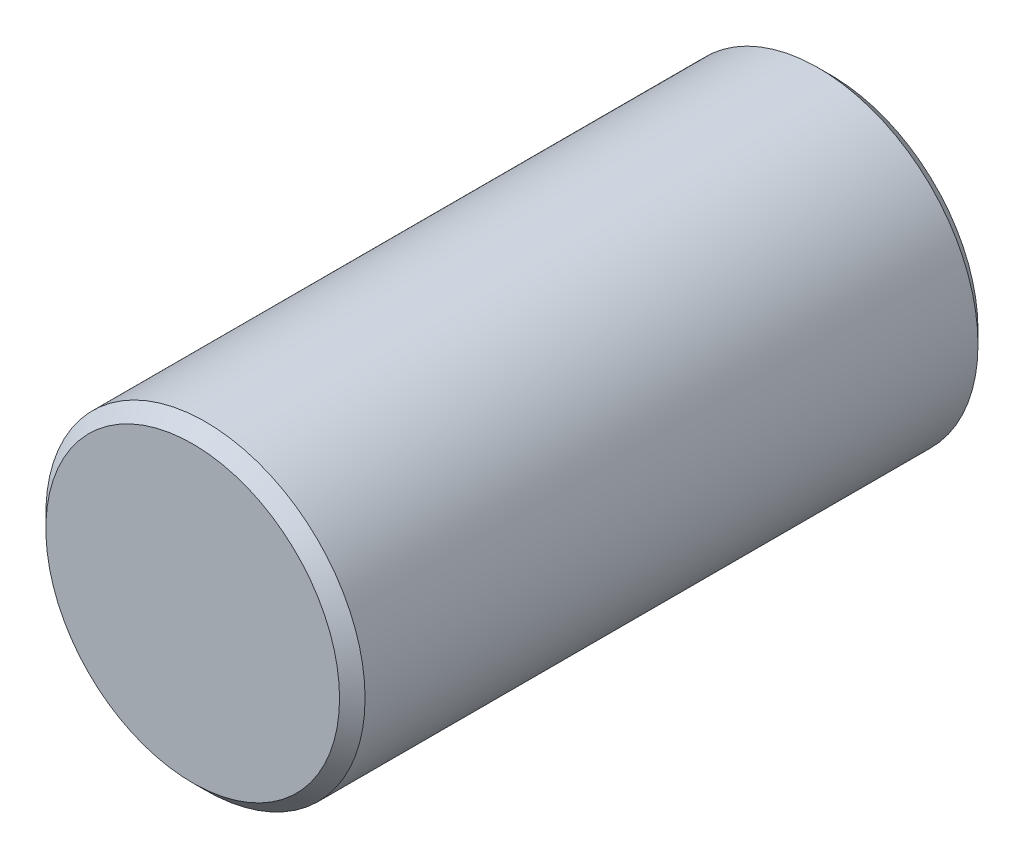
ISO-10303-21;
HEADER;
FILE_DESCRIPTION(('STEP AP214'),'2;1');
FILE_NAME('part.step','',(''),(''),'','','');
FILE_SCHEMA(('AUTOMOTIVE_DESIGN { 1 0 10303 214 1 1 1 1 }'));
ENDSEC;
DATA;
#1=APPLICATION_CONTEXT('core data for automotive mechanical design processes');
#2=APPLICATION_PROTOCOL_DEFINITION('international standard','automotive_design',2000,#1);
#3=PRODUCT_CONTEXT('',#1,'mechanical');
#4=PRODUCT('Part','Part','',(#3));
#5=PRODUCT_RELATED_PRODUCT_CATEGORY('part','',(#4));
#6=PRODUCT_DEFINITION_FORMATION('','',#4);
#7=PRODUCT_DEFINITION_CONTEXT('part definition',#1,'design');
#8=PRODUCT_DEFINITION('design','',#6,#7);
#9=PRODUCT_DEFINITION_SHAPE('','',#8);
#10=(LENGTH_UNIT() NAMED_UNIT(*) SI_UNIT(.MILLI.,.METRE.));
#11=(NAMED_UNIT(*) PLANE_ANGLE_UNIT() SI_UNIT($,.RADIAN.));
#12=(NAMED_UNIT(*) SI_UNIT($,.STERADIAN.) SOLID_ANGLE_UNIT());
#13=UNCERTAINTY_MEASURE_WITH_UNIT(LENGTH_MEASURE(1.E-05),#10,'distance_accuracy_value','');
#14=(GEOMETRIC_REPRESENTATION_CONTEXT(3) GLOBAL_UNCERTAINTY_ASSIGNED_CONTEXT((#13)) GLOBAL_UNIT_ASSIGNED_CONTEXT((#10,
#11,#12)) REPRESENTATION_CONTEXT('',''));
#15=CARTESIAN_POINT('',(0.,0.,0.));
#16=DIRECTION('',(0.,0.,1.));
#17=DIRECTION('',(1.,0.,0.));
#18=AXIS2_PLACEMENT_3D('',#15,#16,#17);
#19=CARTESIAN_POINT('',(0.,0.,5.));
#20=DIRECTION('',(0.,0.,-1.));
#21=DIRECTION('',(-1.,0.,0.));
#22=AXIS2_PLACEMENT_3D('',#19,#20,#21);
#23=CYLINDRICAL_SURFACE('',#22,1.25);
#24=CARTESIAN_POINT('',(0.,0.,0.100000000000002));
#25=DIRECTION('',(0.,0.,1.));
#26=DIRECTION('',(1.,0.,0.));
#27=AXIS2_PLACEMENT_3D('',#24,#25,#26);
#28=CIRCLE('',#27,1.25);
#29=CARTESIAN_POINT('',(1.25,0.,0.100000000000002));
#30=VERTEX_POINT('',#29);
#31=EDGE_CURVE('E58',#30,#30,#28,.T.);
#32=ORIENTED_EDGE('',*,*,#31,.T.);
#33=EDGE_LOOP('',(#32));
#34=FACE_BOUND('',#33,.T.);
#35=CARTESIAN_POINT('',(0.,0.,4.9));
#36=DIRECTION('',(0.,0.,1.));
#37=DIRECTION('',(1.,0.,0.));
#38=AXIS2_PLACEMENT_3D('',#35,#36,#37);
#39=CIRCLE('',#38,1.25);
#40=CARTESIAN_POINT('',(1.25,0.,4.9));
#41=VERTEX_POINT('',#40);
#42=EDGE_CURVE('E63',#41,#41,#39,.F.);
#43=ORIENTED_EDGE('',*,*,#42,.T.);
#44=EDGE_LOOP('',(#43));
#45=FACE_BOUND('',#44,.T.);
#46=ADVANCED_FACE('F44',(#34,#45),#23,.T.);
#47=CARTESIAN_POINT('',(0.,0.,5.));
#48=DIRECTION('',(0.,0.,1.));
#49=DIRECTION('',(1.,0.,0.));
#50=AXIS2_PLACEMENT_3D('',#47,#48,#49);
#51=PLANE('',#50);
#52=CARTESIAN_POINT('',(0.,0.,5.));
#53=DIRECTION('',(0.,0.,1.));
#54=DIRECTION('',(1.,0.,0.));
#55=AXIS2_PLACEMENT_3D('',#52,#53,#54);
#56=CIRCLE('',#55,1.15);
#57=CARTESIAN_POINT('',(1.15,0.,5.));
#58=VERTEX_POINT('',#57);
#59=EDGE_CURVE('E10',#58,#58,#56,.T.);
#60=ORIENTED_EDGE('',*,*,#59,.T.);
#61=EDGE_LOOP('',(#60));
#62=FACE_BOUND('',#61,.T.);
#63=ADVANCED_FACE('F80',(#62),#51,.T.);
#64=CARTESIAN_POINT('',(0.,0.,0.));
#65=DIRECTION('',(0.,0.,1.));
#66=DIRECTION('',(1.,0.,0.));
#67=AXIS2_PLACEMENT_3D('',#64,#65,#66);
#68=PLANE('',#67);
#69=CARTESIAN_POINT('',(0.,0.,0.));
#70=DIRECTION('',(0.,0.,1.));
#71=DIRECTION('',(1.,0.,0.));
#72=AXIS2_PLACEMENT_3D('',#69,#70,#71);
#73=CIRCLE('',#72,1.15);
#74=CARTESIAN_POINT('',(1.15,0.,0.));
#75=VERTEX_POINT('',#74);
#76=EDGE_CURVE('E53',#75,#75,#73,.F.);
#77=ORIENTED_EDGE('',*,*,#76,.T.);
#78=EDGE_LOOP('',(#77));
#79=FACE_BOUND('',#78,.T.);
#80=ADVANCED_FACE('F77',(#79),#68,.F.);
#81=CARTESIAN_POINT('',(0.,0.,0.100000000000002));
#82=DIRECTION('',(0.,0.,1.));
#83=DIRECTION('',(1.,0.,0.));
#84=AXIS2_PLACEMENT_3D('',#81,#82,#83);
#85=CONICAL_SURFACE('',#84,1.25,0.785398163397446);
#86=ORIENTED_EDGE('',*,*,#76,.F.);
#87=EDGE_LOOP('',(#86));
#88=FACE_BOUND('',#87,.T.);
#89=ORIENTED_EDGE('',*,*,#31,.F.);
#90=EDGE_LOOP('',(#89));
#91=FACE_BOUND('',#90,.T.);
#92=ADVANCED_FACE('F73',(#88,#91),#85,.T.);
#93=CARTESIAN_POINT('',(0.,0.,5.));
#94=DIRECTION('',(0.,0.,-1.));
#95=DIRECTION('',(-1.,0.,0.));
#96=AXIS2_PLACEMENT_3D('',#93,#94,#95);
#97=CONICAL_SURFACE('',#96,1.15,0.78539816339744);
#98=ORIENTED_EDGE('',*,*,#42,.F.);
#99=EDGE_LOOP('',(#98));
#100=FACE_BOUND('',#99,.T.);
#101=ORIENTED_EDGE('',*,*,#59,.F.);
#102=EDGE_LOOP('',(#101));
#103=FACE_BOUND('',#102,.T.);
#104=ADVANCED_FACE('F47',(#100,#103),#97,.T.);
#105=CLOSED_SHELL('',(#46,#63,#80,#92,#104));
#106=MANIFOLD_SOLID_BREP('B2',#105);
#107=ADVANCED_BREP_SHAPE_REPRESENTATION('',(#18,#106),#14);
#108=SHAPE_DEFINITION_REPRESENTATION(#9,#107);
ENDSEC;
END-ISO-10303-21;
